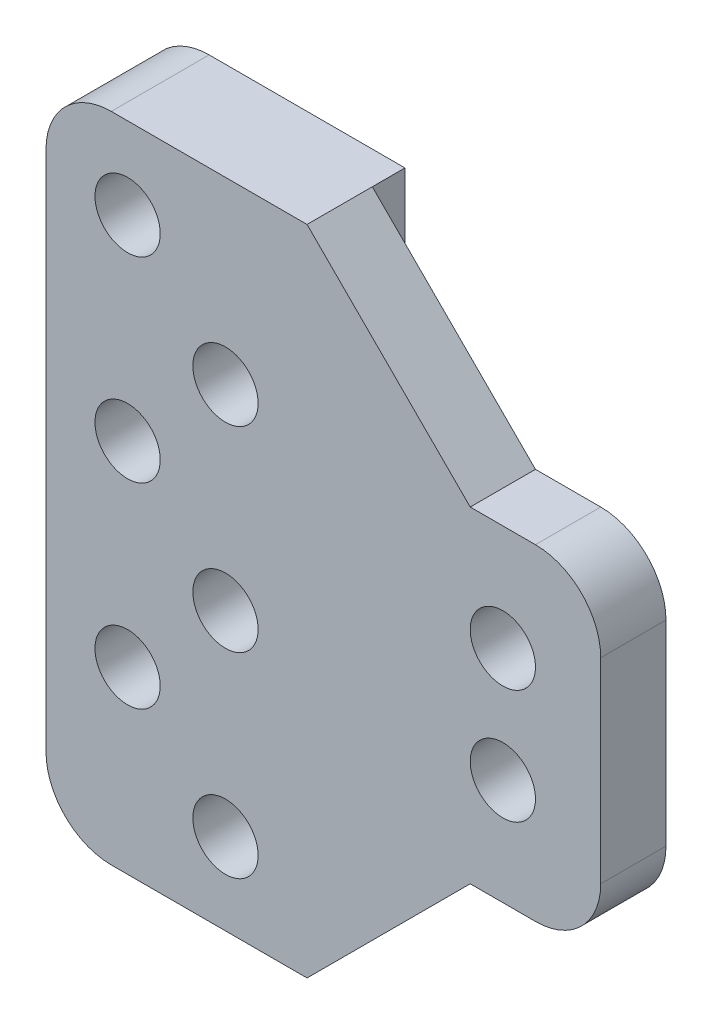
ISO-10303-21;
HEADER;
FILE_DESCRIPTION(('STEP AP214'),'2;1');
FILE_NAME('part.step','',(''),(''),'','','');
FILE_SCHEMA(('AUTOMOTIVE_DESIGN { 1 0 10303 214 1 1 1 1 }'));
ENDSEC;
DATA;
#1=APPLICATION_CONTEXT('core data for automotive mechanical design processes');
#2=APPLICATION_PROTOCOL_DEFINITION('international standard','automotive_design',2000,#1);
#3=PRODUCT_CONTEXT('',#1,'mechanical');
#4=PRODUCT('Part','Part','',(#3));
#5=PRODUCT_RELATED_PRODUCT_CATEGORY('part','',(#4));
#6=PRODUCT_DEFINITION_FORMATION('','',#4);
#7=PRODUCT_DEFINITION_CONTEXT('part definition',#1,'design');
#8=PRODUCT_DEFINITION('design','',#6,#7);
#9=PRODUCT_DEFINITION_SHAPE('','',#8);
#10=(LENGTH_UNIT() NAMED_UNIT(*) SI_UNIT(.MILLI.,.METRE.));
#11=(NAMED_UNIT(*) PLANE_ANGLE_UNIT() SI_UNIT($,.RADIAN.));
#12=(NAMED_UNIT(*) SI_UNIT($,.STERADIAN.) SOLID_ANGLE_UNIT());
#13=UNCERTAINTY_MEASURE_WITH_UNIT(LENGTH_MEASURE(1.E-05),#10,'distance_accuracy_value','');
#14=(GEOMETRIC_REPRESENTATION_CONTEXT(3) GLOBAL_UNCERTAINTY_ASSIGNED_CONTEXT((#13)) GLOBAL_UNIT_ASSIGNED_CONTEXT((#10,
#11,#12)) REPRESENTATION_CONTEXT('',''));
#15=CARTESIAN_POINT('',(0.,0.,0.));
#16=DIRECTION('',(0.,0.,1.));
#17=DIRECTION('',(1.,0.,0.));
#18=AXIS2_PLACEMENT_3D('',#15,#16,#17);
#19=CARTESIAN_POINT('',(-11.5,7.5,-3.));
#20=DIRECTION('',(0.,0.,1.));
#21=DIRECTION('',(1.,0.,0.));
#22=AXIS2_PLACEMENT_3D('',#19,#20,#21);
#23=CYLINDRICAL_SURFACE('',#22,1.);
#24=CARTESIAN_POINT('',(-11.5,7.5,-1.));
#25=DIRECTION('',(0.,0.,-1.));
#26=DIRECTION('',(-1.,0.,0.));
#27=AXIS2_PLACEMENT_3D('',#24,#25,#26);
#28=CIRCLE('',#27,1.);
#29=CARTESIAN_POINT('',(-12.5,7.5,-1.));
#30=VERTEX_POINT('',#29);
#31=EDGE_CURVE('E217',#30,#30,#28,.T.);
#32=ORIENTED_EDGE('',*,*,#31,.T.);
#33=EDGE_LOOP('',(#32));
#34=FACE_BOUND('',#33,.T.);
#35=CARTESIAN_POINT('',(-11.5,7.5,2.));
#36=DIRECTION('',(0.,0.,1.));
#37=DIRECTION('',(1.,0.,0.));
#38=AXIS2_PLACEMENT_3D('',#35,#36,#37);
#39=CIRCLE('',#38,1.);
#40=CARTESIAN_POINT('',(-10.5,7.5,2.));
#41=VERTEX_POINT('',#40);
#42=EDGE_CURVE('E220',#41,#41,#39,.T.);
#43=ORIENTED_EDGE('',*,*,#42,.T.);
#44=EDGE_LOOP('',(#43));
#45=FACE_BOUND('',#44,.T.);
#46=ADVANCED_FACE('F36',(#34,#45),#23,.F.);
#47=CARTESIAN_POINT('',(-8.5,4.5,-3.));
#48=DIRECTION('',(0.,0.,1.));
#49=DIRECTION('',(1.,0.,0.));
#50=AXIS2_PLACEMENT_3D('',#47,#48,#49);
#51=CYLINDRICAL_SURFACE('',#50,1.);
#52=CARTESIAN_POINT('',(-8.5,4.5,-1.));
#53=DIRECTION('',(0.,0.,-1.));
#54=DIRECTION('',(-1.,0.,0.));
#55=AXIS2_PLACEMENT_3D('',#52,#53,#54);
#56=CIRCLE('',#55,1.);
#57=CARTESIAN_POINT('',(-9.5,4.5,-1.));
#58=VERTEX_POINT('',#57);
#59=EDGE_CURVE('E173',#58,#58,#56,.T.);
#60=ORIENTED_EDGE('',*,*,#59,.T.);
#61=EDGE_LOOP('',(#60));
#62=FACE_BOUND('',#61,.T.);
#63=CARTESIAN_POINT('',(-8.5,4.5,2.));
#64=DIRECTION('',(0.,0.,1.));
#65=DIRECTION('',(1.,0.,0.));
#66=AXIS2_PLACEMENT_3D('',#63,#64,#65);
#67=CIRCLE('',#66,1.);
#68=CARTESIAN_POINT('',(-7.5,4.5,2.));
#69=VERTEX_POINT('',#68);
#70=EDGE_CURVE('E214',#69,#69,#67,.T.);
#71=ORIENTED_EDGE('',*,*,#70,.T.);
#72=EDGE_LOOP('',(#71));
#73=FACE_BOUND('',#72,.T.);
#74=ADVANCED_FACE('F319',(#62,#73),#51,.F.);
#75=CARTESIAN_POINT('',(0.,0.,0.));
#76=DIRECTION('',(0.,0.,1.));
#77=DIRECTION('',(1.,0.,0.));
#78=AXIS2_PLACEMENT_3D('',#75,#76,#77);
#79=PLANE('',#78);
#80=CARTESIAN_POINT('',(0.,-1.75,0.));
#81=DIRECTION('',(0.,0.,1.));
#82=DIRECTION('',(1.,0.,0.));
#83=AXIS2_PLACEMENT_3D('',#80,#81,#82);
#84=CIRCLE('',#83,1.);
#85=CARTESIAN_POINT('',(1.,-1.75,0.));
#86=VERTEX_POINT('',#85);
#87=EDGE_CURVE('E141',#86,#86,#84,.T.);
#88=ORIENTED_EDGE('',*,*,#87,.T.);
#89=EDGE_LOOP('',(#88));
#90=FACE_BOUND('',#89,.T.);
#91=CARTESIAN_POINT('',(0.,1.75,0.));
#92=DIRECTION('',(0.,0.,1.));
#93=DIRECTION('',(1.,0.,0.));
#94=AXIS2_PLACEMENT_3D('',#91,#92,#93);
#95=CIRCLE('',#94,1.);
#96=CARTESIAN_POINT('',(0.999999999999999,1.75,0.));
#97=VERTEX_POINT('',#96);
#98=EDGE_CURVE('E188',#97,#97,#95,.T.);
#99=ORIENTED_EDGE('',*,*,#98,.T.);
#100=EDGE_LOOP('',(#99));
#101=FACE_BOUND('',#100,.T.);
#102=DIRECTION('',(-1.,0.,0.));
#103=VECTOR('',#102,1.);
#104=CARTESIAN_POINT('',(-3.,5.,0.));
#105=LINE('',#104,#103);
#106=CARTESIAN_POINT('',(0.999999999999999,5.,0.));
#107=VERTEX_POINT('',#106);
#108=CARTESIAN_POINT('',(-0.999999999999968,5.,0.));
#109=VERTEX_POINT('',#108);
#110=EDGE_CURVE('E206',#107,#109,#105,.T.);
#111=ORIENTED_EDGE('',*,*,#110,.F.);
#112=CARTESIAN_POINT('',(0.999999999999999,3.,0.));
#113=DIRECTION('',(0.,0.,1.));
#114=DIRECTION('',(1.,0.,0.));
#115=AXIS2_PLACEMENT_3D('',#112,#113,#114);
#116=CIRCLE('',#115,2.);
#117=CARTESIAN_POINT('',(3.,3.,0.));
#118=VERTEX_POINT('',#117);
#119=EDGE_CURVE('E57',#107,#118,#116,.F.);
#120=ORIENTED_EDGE('',*,*,#119,.T.);
#121=DIRECTION('',(0.,1.,0.));
#122=VECTOR('',#121,1.);
#123=CARTESIAN_POINT('',(3.,5.,0.));
#124=LINE('',#123,#122);
#125=CARTESIAN_POINT('',(3.,-3.,0.));
#126=VERTEX_POINT('',#125);
#127=EDGE_CURVE('E194',#126,#118,#124,.T.);
#128=ORIENTED_EDGE('',*,*,#127,.F.);
#129=CARTESIAN_POINT('',(1.,-3.,0.));
#130=DIRECTION('',(0.,0.,1.));
#131=DIRECTION('',(1.,0.,0.));
#132=AXIS2_PLACEMENT_3D('',#129,#130,#131);
#133=CIRCLE('',#132,2.);
#134=CARTESIAN_POINT('',(1.,-5.,0.));
#135=VERTEX_POINT('',#134);
#136=EDGE_CURVE('E51',#126,#135,#133,.F.);
#137=ORIENTED_EDGE('',*,*,#136,.T.);
#138=DIRECTION('',(1.,0.,0.));
#139=VECTOR('',#138,1.);
#140=CARTESIAN_POINT('',(-3.,-5.,0.));
#141=LINE('',#140,#139);
#142=CARTESIAN_POINT('',(-1.00000000000007,-5.,0.));
#143=VERTEX_POINT('',#142);
#144=EDGE_CURVE('E201',#143,#135,#141,.T.);
#145=ORIENTED_EDGE('',*,*,#144,.F.);
#146=DIRECTION('',(-0.707106781186544,-0.707106781186551,0.));
#147=VECTOR('',#146,1.);
#148=CARTESIAN_POINT('',(1.99999999999996,-1.99999999999994,0.));
#149=LINE('',#148,#147);
#150=CARTESIAN_POINT('',(-6.00000000000005,-10.,0.));
#151=VERTEX_POINT('',#150);
#152=EDGE_CURVE('E230',#143,#151,#149,.T.);
#153=ORIENTED_EDGE('',*,*,#152,.T.);
#154=DIRECTION('',(0.,-1.,0.));
#155=VECTOR('',#154,1.);
#156=CARTESIAN_POINT('',(-6.,10.,0.));
#157=LINE('',#156,#155);
#158=CARTESIAN_POINT('',(-6.,10.,0.));
#159=VERTEX_POINT('',#158);
#160=EDGE_CURVE('E136',#159,#151,#157,.T.);
#161=ORIENTED_EDGE('',*,*,#160,.F.);
#162=DIRECTION('',(0.707106781186552,-0.707106781186544,0.));
#163=VECTOR('',#162,1.);
#164=CARTESIAN_POINT('',(2.00000000000002,2.00000000000004,0.));
#165=LINE('',#164,#163);
#166=EDGE_CURVE('E234',#159,#109,#165,.T.);
#167=ORIENTED_EDGE('',*,*,#166,.T.);
#168=EDGE_LOOP('',(#111,#120,#128,#137,#145,#153,#161,#167));
#169=FACE_BOUND('',#168,.T.);
#170=ADVANCED_FACE('F281',(#90,#101,#169),#79,.F.);
#171=CARTESIAN_POINT('',(0.,0.,2.));
#172=DIRECTION('',(0.,0.,1.));
#173=DIRECTION('',(1.,0.,0.));
#174=AXIS2_PLACEMENT_3D('',#171,#172,#173);
#175=PLANE('',#174);
#176=CARTESIAN_POINT('',(-11.5,1.5,2.));
#177=DIRECTION('',(0.,0.,1.));
#178=DIRECTION('',(1.,0.,0.));
#179=AXIS2_PLACEMENT_3D('',#176,#177,#178);
#180=CIRCLE('',#179,1.);
#181=CARTESIAN_POINT('',(-10.5,1.5,2.));
#182=VERTEX_POINT('',#181);
#183=EDGE_CURVE('E559',#182,#182,#180,.T.);
#184=ORIENTED_EDGE('',*,*,#183,.F.);
#185=EDGE_LOOP('',(#184));
#186=FACE_BOUND('',#185,.T.);
#187=CARTESIAN_POINT('',(-8.5,-1.5,2.));
#188=DIRECTION('',(0.,0.,1.));
#189=DIRECTION('',(1.,0.,0.));
#190=AXIS2_PLACEMENT_3D('',#187,#188,#189);
#191=CIRCLE('',#190,1.);
#192=CARTESIAN_POINT('',(-7.5,-1.5,2.));
#193=VERTEX_POINT('',#192);
#194=EDGE_CURVE('E563',#193,#193,#191,.T.);
#195=ORIENTED_EDGE('',*,*,#194,.F.);
#196=EDGE_LOOP('',(#195));
#197=FACE_BOUND('',#196,.T.);
#198=CARTESIAN_POINT('',(-8.5,-7.5,2.));
#199=DIRECTION('',(0.,0.,1.));
#200=DIRECTION('',(1.,0.,0.));
#201=AXIS2_PLACEMENT_3D('',#198,#199,#200);
#202=CIRCLE('',#201,1.);
#203=CARTESIAN_POINT('',(-7.5,-7.5,2.));
#204=VERTEX_POINT('',#203);
#205=EDGE_CURVE('E210',#204,#204,#202,.T.);
#206=ORIENTED_EDGE('',*,*,#205,.F.);
#207=EDGE_LOOP('',(#206));
#208=FACE_BOUND('',#207,.T.);
#209=CARTESIAN_POINT('',(-11.5,-4.5,2.));
#210=DIRECTION('',(0.,0.,1.));
#211=DIRECTION('',(1.,0.,0.));
#212=AXIS2_PLACEMENT_3D('',#209,#210,#211);
#213=CIRCLE('',#212,1.);
#214=CARTESIAN_POINT('',(-10.5,-4.5,2.));
#215=VERTEX_POINT('',#214);
#216=EDGE_CURVE('E165',#215,#215,#213,.T.);
#217=ORIENTED_EDGE('',*,*,#216,.F.);
#218=EDGE_LOOP('',(#217));
#219=FACE_BOUND('',#218,.T.);
#220=CARTESIAN_POINT('',(0.,1.75,2.));
#221=DIRECTION('',(0.,0.,1.));
#222=DIRECTION('',(1.,0.,0.));
#223=AXIS2_PLACEMENT_3D('',#220,#221,#222);
#224=CIRCLE('',#223,1.);
#225=CARTESIAN_POINT('',(0.999999999999999,1.75,2.));
#226=VERTEX_POINT('',#225);
#227=EDGE_CURVE('E191',#226,#226,#224,.T.);
#228=ORIENTED_EDGE('',*,*,#227,.F.);
#229=EDGE_LOOP('',(#228));
#230=FACE_BOUND('',#229,.T.);
#231=DIRECTION('',(0.,-1.,0.));
#232=VECTOR('',#231,1.);
#233=CARTESIAN_POINT('',(-14.,-10.,2.));
#234=LINE('',#233,#232);
#235=CARTESIAN_POINT('',(-14.,8.,2.));
#236=VERTEX_POINT('',#235);
#237=CARTESIAN_POINT('',(-14.,-8.,2.));
#238=VERTEX_POINT('',#237);
#239=EDGE_CURVE('E177',#236,#238,#234,.T.);
#240=ORIENTED_EDGE('',*,*,#239,.T.);
#241=CARTESIAN_POINT('',(-12.,-8.,2.));
#242=DIRECTION('',(0.,0.,1.));
#243=DIRECTION('',(1.,0.,0.));
#244=AXIS2_PLACEMENT_3D('',#241,#242,#243);
#245=CIRCLE('',#244,2.);
#246=CARTESIAN_POINT('',(-12.,-10.,2.));
#247=VERTEX_POINT('',#246);
#248=EDGE_CURVE('E248',#238,#247,#245,.T.);
#249=ORIENTED_EDGE('',*,*,#248,.T.);
#250=DIRECTION('',(1.,0.,0.));
#251=VECTOR('',#250,1.);
#252=CARTESIAN_POINT('',(-6.00000000000005,-10.,2.));
#253=LINE('',#252,#251);
#254=CARTESIAN_POINT('',(-6.00000000000005,-10.,2.));
#255=VERTEX_POINT('',#254);
#256=EDGE_CURVE('E180',#247,#255,#253,.T.);
#257=ORIENTED_EDGE('',*,*,#256,.T.);
#258=DIRECTION('',(0.707106781186544,0.707106781186551,0.));
#259=VECTOR('',#258,1.);
#260=CARTESIAN_POINT('',(-6.00000000000005,-10.,2.));
#261=LINE('',#260,#259);
#262=CARTESIAN_POINT('',(-1.00000000000007,-5.,2.));
#263=VERTEX_POINT('',#262);
#264=EDGE_CURVE('E228',#255,#263,#261,.T.);
#265=ORIENTED_EDGE('',*,*,#264,.T.);
#266=DIRECTION('',(1.,0.,0.));
#267=VECTOR('',#266,1.);
#268=CARTESIAN_POINT('',(-3.,-5.,2.));
#269=LINE('',#268,#267);
#270=CARTESIAN_POINT('',(1.,-5.,2.));
#271=VERTEX_POINT('',#270);
#272=EDGE_CURVE('E174',#263,#271,#269,.T.);
#273=ORIENTED_EDGE('',*,*,#272,.T.);
#274=CARTESIAN_POINT('',(1.,-3.,2.));
#275=DIRECTION('',(0.,0.,1.));
#276=DIRECTION('',(1.,0.,0.));
#277=AXIS2_PLACEMENT_3D('',#274,#275,#276);
#278=CIRCLE('',#277,2.);
#279=CARTESIAN_POINT('',(3.,-3.,2.));
#280=VERTEX_POINT('',#279);
#281=EDGE_CURVE('E242',#271,#280,#278,.T.);
#282=ORIENTED_EDGE('',*,*,#281,.T.);
#283=DIRECTION('',(0.,1.,0.));
#284=VECTOR('',#283,1.);
#285=CARTESIAN_POINT('',(3.,5.,2.));
#286=LINE('',#285,#284);
#287=CARTESIAN_POINT('',(3.,3.,2.));
#288=VERTEX_POINT('',#287);
#289=EDGE_CURVE('E197',#280,#288,#286,.T.);
#290=ORIENTED_EDGE('',*,*,#289,.T.);
#291=CARTESIAN_POINT('',(0.999999999999999,3.,2.));
#292=DIRECTION('',(0.,0.,1.));
#293=DIRECTION('',(1.,0.,0.));
#294=AXIS2_PLACEMENT_3D('',#291,#292,#293);
#295=CIRCLE('',#294,2.);
#296=CARTESIAN_POINT('',(0.999999999999999,5.,2.));
#297=VERTEX_POINT('',#296);
#298=EDGE_CURVE('E244',#288,#297,#295,.T.);
#299=ORIENTED_EDGE('',*,*,#298,.T.);
#300=DIRECTION('',(-1.,0.,0.));
#301=VECTOR('',#300,1.);
#302=CARTESIAN_POINT('',(-3.,5.,2.));
#303=LINE('',#302,#301);
#304=CARTESIAN_POINT('',(-0.999999999999968,5.,2.));
#305=VERTEX_POINT('',#304);
#306=EDGE_CURVE('E200',#297,#305,#303,.T.);
#307=ORIENTED_EDGE('',*,*,#306,.T.);
#308=DIRECTION('',(-0.707106781186552,0.707106781186544,0.));
#309=VECTOR('',#308,1.);
#310=CARTESIAN_POINT('',(-0.999999999999968,5.,2.));
#311=LINE('',#310,#309);
#312=CARTESIAN_POINT('',(-6.,10.,2.));
#313=VERTEX_POINT('',#312);
#314=EDGE_CURVE('E232',#305,#313,#311,.T.);
#315=ORIENTED_EDGE('',*,*,#314,.T.);
#316=DIRECTION('',(-1.,0.,0.));
#317=VECTOR('',#316,1.);
#318=CARTESIAN_POINT('',(-14.,10.,2.));
#319=LINE('',#318,#317);
#320=CARTESIAN_POINT('',(-12.,10.,2.));
#321=VERTEX_POINT('',#320);
#322=EDGE_CURVE('E171',#313,#321,#319,.T.);
#323=ORIENTED_EDGE('',*,*,#322,.T.);
#324=CARTESIAN_POINT('',(-12.,8.,2.));
#325=DIRECTION('',(0.,0.,1.));
#326=DIRECTION('',(1.,0.,0.));
#327=AXIS2_PLACEMENT_3D('',#324,#325,#326);
#328=CIRCLE('',#327,2.);
#329=EDGE_CURVE('E246',#321,#236,#328,.T.);
#330=ORIENTED_EDGE('',*,*,#329,.T.);
#331=EDGE_LOOP('',(#240,#249,#257,#265,#273,#282,#290,#299,#307,#315,#323,#330));
#332=FACE_BOUND('',#331,.T.);
#333=CARTESIAN_POINT('',(0.,-1.75,2.));
#334=DIRECTION('',(0.,0.,1.));
#335=DIRECTION('',(1.,0.,0.));
#336=AXIS2_PLACEMENT_3D('',#333,#334,#335);
#337=CIRCLE('',#336,1.);
#338=CARTESIAN_POINT('',(1.,-1.75,2.));
#339=VERTEX_POINT('',#338);
#340=EDGE_CURVE('E185',#339,#339,#337,.T.);
#341=ORIENTED_EDGE('',*,*,#340,.F.);
#342=EDGE_LOOP('',(#341));
#343=FACE_BOUND('',#342,.T.);
#344=ORIENTED_EDGE('',*,*,#70,.F.);
#345=EDGE_LOOP('',(#344));
#346=FACE_BOUND('',#345,.T.);
#347=ORIENTED_EDGE('',*,*,#42,.F.);
#348=EDGE_LOOP('',(#347));
#349=FACE_BOUND('',#348,.T.);
#350=ADVANCED_FACE('F273',(#186,#197,#208,#219,#230,#332,#343,#346,#349),#175,.T.);
#351=CARTESIAN_POINT('',(3.,5.,2.));
#352=DIRECTION('',(-1.,0.,0.));
#353=DIRECTION('',(0.,-1.,0.));
#354=AXIS2_PLACEMENT_3D('',#351,#352,#353);
#355=PLANE('',#354);
#356=ORIENTED_EDGE('',*,*,#127,.T.);
#357=DIRECTION('',(0.,0.,-1.));
#358=VECTOR('',#357,1.);
#359=CARTESIAN_POINT('',(3.,3.,2.));
#360=LINE('',#359,#358);
#361=EDGE_CURVE('E44',#118,#288,#360,.F.);
#362=ORIENTED_EDGE('',*,*,#361,.T.);
#363=ORIENTED_EDGE('',*,*,#289,.F.);
#364=DIRECTION('',(0.,0.,-1.));
#365=VECTOR('',#364,1.);
#366=CARTESIAN_POINT('',(3.,-3.,2.));
#367=LINE('',#366,#365);
#368=EDGE_CURVE('E263',#280,#126,#367,.T.);
#369=ORIENTED_EDGE('',*,*,#368,.T.);
#370=EDGE_LOOP('',(#356,#362,#363,#369));
#371=FACE_BOUND('',#370,.T.);
#372=ADVANCED_FACE('F268',(#371),#355,.F.);
#373=CARTESIAN_POINT('',(-3.,5.,2.));
#374=DIRECTION('',(0.,-1.,0.));
#375=DIRECTION('',(1.,0.,0.));
#376=AXIS2_PLACEMENT_3D('',#373,#374,#375);
#377=PLANE('',#376);
#378=ORIENTED_EDGE('',*,*,#306,.F.);
#379=DIRECTION('',(0.,0.,-1.));
#380=VECTOR('',#379,1.);
#381=CARTESIAN_POINT('',(0.999999999999999,5.,2.));
#382=LINE('',#381,#380);
#383=EDGE_CURVE('E258',#297,#107,#382,.T.);
#384=ORIENTED_EDGE('',*,*,#383,.T.);
#385=ORIENTED_EDGE('',*,*,#110,.T.);
#386=DIRECTION('',(0.,0.,1.));
#387=VECTOR('',#386,1.);
#388=CARTESIAN_POINT('',(-0.999999999999968,5.,2.));
#389=LINE('',#388,#387);
#390=EDGE_CURVE('E225',#109,#305,#389,.T.);
#391=ORIENTED_EDGE('',*,*,#390,.T.);
#392=EDGE_LOOP('',(#378,#384,#385,#391));
#393=FACE_BOUND('',#392,.T.);
#394=ADVANCED_FACE('F280',(#393),#377,.F.);
#395=CARTESIAN_POINT('',(-3.,-5.,2.));
#396=DIRECTION('',(0.,1.,0.));
#397=DIRECTION('',(-1.,0.,0.));
#398=AXIS2_PLACEMENT_3D('',#395,#396,#397);
#399=PLANE('',#398);
#400=ORIENTED_EDGE('',*,*,#144,.T.);
#401=DIRECTION('',(0.,0.,-1.));
#402=VECTOR('',#401,1.);
#403=CARTESIAN_POINT('',(1.,-5.,2.));
#404=LINE('',#403,#402);
#405=EDGE_CURVE('E11',#135,#271,#404,.F.);
#406=ORIENTED_EDGE('',*,*,#405,.T.);
#407=ORIENTED_EDGE('',*,*,#272,.F.);
#408=DIRECTION('',(0.,0.,-1.));
#409=VECTOR('',#408,1.);
#410=CARTESIAN_POINT('',(-1.00000000000007,-5.,2.));
#411=LINE('',#410,#409);
#412=EDGE_CURVE('E223',#263,#143,#411,.T.);
#413=ORIENTED_EDGE('',*,*,#412,.T.);
#414=EDGE_LOOP('',(#400,#406,#407,#413));
#415=FACE_BOUND('',#414,.T.);
#416=ADVANCED_FACE('F311',(#415),#399,.F.);
#417=CARTESIAN_POINT('',(0.,1.75,2.));
#418=DIRECTION('',(0.,0.,-1.));
#419=DIRECTION('',(-1.,0.,0.));
#420=AXIS2_PLACEMENT_3D('',#417,#418,#419);
#421=CYLINDRICAL_SURFACE('',#420,1.);
#422=ORIENTED_EDGE('',*,*,#227,.T.);
#423=EDGE_LOOP('',(#422));
#424=FACE_BOUND('',#423,.T.);
#425=ORIENTED_EDGE('',*,*,#98,.F.);
#426=EDGE_LOOP('',(#425));
#427=FACE_BOUND('',#426,.T.);
#428=ADVANCED_FACE('F483',(#424,#427),#421,.F.);
#429=CARTESIAN_POINT('',(0.,-1.75,2.));
#430=DIRECTION('',(0.,0.,-1.));
#431=DIRECTION('',(-1.,0.,0.));
#432=AXIS2_PLACEMENT_3D('',#429,#430,#431);
#433=CYLINDRICAL_SURFACE('',#432,1.);
#434=ORIENTED_EDGE('',*,*,#340,.T.);
#435=EDGE_LOOP('',(#434));
#436=FACE_BOUND('',#435,.T.);
#437=ORIENTED_EDGE('',*,*,#87,.F.);
#438=EDGE_LOOP('',(#437));
#439=FACE_BOUND('',#438,.T.);
#440=ADVANCED_FACE('F463',(#436,#439),#433,.F.);
#441=CARTESIAN_POINT('',(-6.00000000000005,-5.,0.));
#442=DIRECTION('',(1.,0.,0.));
#443=DIRECTION('',(0.,1.,0.));
#444=AXIS2_PLACEMENT_3D('',#441,#442,#443);
#445=PLANE('',#444);
#446=ORIENTED_EDGE('',*,*,#160,.T.);
#447=DIRECTION('',(0.,0.,1.));
#448=VECTOR('',#447,1.);
#449=CARTESIAN_POINT('',(-6.00000000000005,-10.,0.));
#450=LINE('',#449,#448);
#451=CARTESIAN_POINT('',(-6.,-10.,-1.));
#452=VERTEX_POINT('',#451);
#453=EDGE_CURVE('E130',#452,#151,#450,.T.);
#454=ORIENTED_EDGE('',*,*,#453,.F.);
#455=DIRECTION('',(0.,-1.,0.));
#456=VECTOR('',#455,1.);
#457=CARTESIAN_POINT('',(-6.,10.,-1.));
#458=LINE('',#457,#456);
#459=CARTESIAN_POINT('',(-6.,10.,-1.));
#460=VERTEX_POINT('',#459);
#461=EDGE_CURVE('E135',#460,#452,#458,.T.);
#462=ORIENTED_EDGE('',*,*,#461,.F.);
#463=DIRECTION('',(0.,0.,1.));
#464=VECTOR('',#463,1.);
#465=CARTESIAN_POINT('',(-6.,10.,0.));
#466=LINE('',#465,#464);
#467=EDGE_CURVE('E183',#460,#159,#466,.T.);
#468=ORIENTED_EDGE('',*,*,#467,.T.);
#469=EDGE_LOOP('',(#446,#454,#462,#468));
#470=FACE_BOUND('',#469,.T.);
#471=ADVANCED_FACE('F132',(#470),#445,.T.);
#472=CARTESIAN_POINT('',(-6.00000000000005,-10.,0.));
#473=DIRECTION('',(0.,-1.,0.));
#474=DIRECTION('',(1.,0.,0.));
#475=AXIS2_PLACEMENT_3D('',#472,#473,#474);
#476=PLANE('',#475);
#477=ORIENTED_EDGE('',*,*,#256,.F.);
#478=DIRECTION('',(0.,0.,1.));
#479=VECTOR('',#478,1.);
#480=CARTESIAN_POINT('',(-12.,-10.,0.));
#481=LINE('',#480,#479);
#482=CARTESIAN_POINT('',(-12.,-10.,-1.));
#483=VERTEX_POINT('',#482);
#484=EDGE_CURVE('E149',#247,#483,#481,.F.);
#485=ORIENTED_EDGE('',*,*,#484,.T.);
#486=DIRECTION('',(-1.,0.,0.));
#487=VECTOR('',#486,1.);
#488=CARTESIAN_POINT('',(-6.,-10.,-1.));
#489=LINE('',#488,#487);
#490=EDGE_CURVE('E145',#452,#483,#489,.T.);
#491=ORIENTED_EDGE('',*,*,#490,.F.);
#492=ORIENTED_EDGE('',*,*,#453,.T.);
#493=EDGE_CURVE('E142',#151,#255,#450,.T.);
#494=ORIENTED_EDGE('',*,*,#493,.T.);
#495=EDGE_LOOP('',(#477,#485,#491,#492,#494));
#496=FACE_BOUND('',#495,.T.);
#497=ADVANCED_FACE('F147',(#496),#476,.T.);
#498=CARTESIAN_POINT('',(-14.,-10.,0.));
#499=DIRECTION('',(-1.,0.,0.));
#500=DIRECTION('',(0.,-1.,0.));
#501=AXIS2_PLACEMENT_3D('',#498,#499,#500);
#502=PLANE('',#501);
#503=DIRECTION('',(0.,1.,0.));
#504=VECTOR('',#503,1.);
#505=CARTESIAN_POINT('',(-14.,10.,-1.));
#506=LINE('',#505,#504);
#507=CARTESIAN_POINT('',(-14.,-8.00000000000001,-1.));
#508=VERTEX_POINT('',#507);
#509=CARTESIAN_POINT('',(-14.,8.,-1.));
#510=VERTEX_POINT('',#509);
#511=EDGE_CURVE('E152',#508,#510,#506,.T.);
#512=ORIENTED_EDGE('',*,*,#511,.F.);
#513=DIRECTION('',(0.,0.,1.));
#514=VECTOR('',#513,1.);
#515=CARTESIAN_POINT('',(-14.,-8.,0.));
#516=LINE('',#515,#514);
#517=EDGE_CURVE('E239',#508,#238,#516,.T.);
#518=ORIENTED_EDGE('',*,*,#517,.T.);
#519=ORIENTED_EDGE('',*,*,#239,.F.);
#520=DIRECTION('',(0.,0.,1.));
#521=VECTOR('',#520,1.);
#522=CARTESIAN_POINT('',(-14.,8.,0.));
#523=LINE('',#522,#521);
#524=EDGE_CURVE('E237',#236,#510,#523,.F.);
#525=ORIENTED_EDGE('',*,*,#524,.T.);
#526=EDGE_LOOP('',(#512,#518,#519,#525));
#527=FACE_BOUND('',#526,.T.);
#528=ADVANCED_FACE('F300',(#527),#502,.T.);
#529=CARTESIAN_POINT('',(-14.,10.,0.));
#530=DIRECTION('',(0.,1.,0.));
#531=DIRECTION('',(0.,0.,1.));
#532=AXIS2_PLACEMENT_3D('',#529,#530,#531);
#533=PLANE('',#532);
#534=DIRECTION('',(1.,0.,0.));
#535=VECTOR('',#534,1.);
#536=CARTESIAN_POINT('',(-6.,10.,-1.));
#537=LINE('',#536,#535);
#538=CARTESIAN_POINT('',(-12.,10.,-1.));
#539=VERTEX_POINT('',#538);
#540=EDGE_CURVE('E157',#539,#460,#537,.T.);
#541=ORIENTED_EDGE('',*,*,#540,.F.);
#542=DIRECTION('',(0.,0.,1.));
#543=VECTOR('',#542,1.);
#544=CARTESIAN_POINT('',(-12.,10.,0.));
#545=LINE('',#544,#543);
#546=EDGE_CURVE('E255',#539,#321,#545,.T.);
#547=ORIENTED_EDGE('',*,*,#546,.T.);
#548=ORIENTED_EDGE('',*,*,#322,.F.);
#549=EDGE_CURVE('E181',#159,#313,#466,.T.);
#550=ORIENTED_EDGE('',*,*,#549,.F.);
#551=ORIENTED_EDGE('',*,*,#467,.F.);
#552=EDGE_LOOP('',(#541,#547,#548,#550,#551));
#553=FACE_BOUND('',#552,.T.);
#554=ADVANCED_FACE('F291',(#553),#533,.T.);
#555=CARTESIAN_POINT('',(0.,0.,-1.));
#556=DIRECTION('',(0.,0.,-1.));
#557=DIRECTION('',(-1.,0.,0.));
#558=AXIS2_PLACEMENT_3D('',#555,#556,#557);
#559=PLANE('',#558);
#560=CARTESIAN_POINT('',(-11.5,1.5,-1.));
#561=DIRECTION('',(0.,0.,-1.));
#562=DIRECTION('',(-1.,0.,0.));
#563=AXIS2_PLACEMENT_3D('',#560,#561,#562);
#564=CIRCLE('',#563,1.);
#565=CARTESIAN_POINT('',(-12.5,1.5,-1.));
#566=VERTEX_POINT('',#565);
#567=EDGE_CURVE('E579',#566,#566,#564,.T.);
#568=ORIENTED_EDGE('',*,*,#567,.F.);
#569=EDGE_LOOP('',(#568));
#570=FACE_BOUND('',#569,.T.);
#571=CARTESIAN_POINT('',(-8.5,-1.5,-1.));
#572=DIRECTION('',(0.,0.,-1.));
#573=DIRECTION('',(-1.,0.,0.));
#574=AXIS2_PLACEMENT_3D('',#571,#572,#573);
#575=CIRCLE('',#574,1.);
#576=CARTESIAN_POINT('',(-9.5,-1.5,-1.));
#577=VERTEX_POINT('',#576);
#578=EDGE_CURVE('E572',#577,#577,#575,.T.);
#579=ORIENTED_EDGE('',*,*,#578,.F.);
#580=EDGE_LOOP('',(#579));
#581=FACE_BOUND('',#580,.T.);
#582=CARTESIAN_POINT('',(-8.5,-7.5,-1.));
#583=DIRECTION('',(0.,0.,-1.));
#584=DIRECTION('',(-1.,0.,0.));
#585=AXIS2_PLACEMENT_3D('',#582,#583,#584);
#586=CIRCLE('',#585,1.);
#587=CARTESIAN_POINT('',(-9.5,-7.5,-1.));
#588=VERTEX_POINT('',#587);
#589=EDGE_CURVE('E159',#588,#588,#586,.T.);
#590=ORIENTED_EDGE('',*,*,#589,.F.);
#591=EDGE_LOOP('',(#590));
#592=FACE_BOUND('',#591,.T.);
#593=CARTESIAN_POINT('',(-11.5,-4.5,-1.));
#594=DIRECTION('',(0.,0.,-1.));
#595=DIRECTION('',(-1.,0.,0.));
#596=AXIS2_PLACEMENT_3D('',#593,#594,#595);
#597=CIRCLE('',#596,1.);
#598=CARTESIAN_POINT('',(-12.5,-4.5,-1.));
#599=VERTEX_POINT('',#598);
#600=EDGE_CURVE('E162',#599,#599,#597,.T.);
#601=ORIENTED_EDGE('',*,*,#600,.F.);
#602=EDGE_LOOP('',(#601));
#603=FACE_BOUND('',#602,.T.);
#604=ORIENTED_EDGE('',*,*,#490,.T.);
#605=CARTESIAN_POINT('',(-12.,-8.,-1.));
#606=DIRECTION('',(0.,0.,-1.));
#607=DIRECTION('',(-1.,0.,0.));
#608=AXIS2_PLACEMENT_3D('',#605,#606,#607);
#609=CIRCLE('',#608,2.);
#610=EDGE_CURVE('E253',#483,#508,#609,.T.);
#611=ORIENTED_EDGE('',*,*,#610,.T.);
#612=ORIENTED_EDGE('',*,*,#511,.T.);
#613=CARTESIAN_POINT('',(-12.,8.,-1.));
#614=DIRECTION('',(0.,0.,-1.));
#615=DIRECTION('',(-1.,0.,0.));
#616=AXIS2_PLACEMENT_3D('',#613,#614,#615);
#617=CIRCLE('',#616,2.);
#618=EDGE_CURVE('E251',#510,#539,#617,.T.);
#619=ORIENTED_EDGE('',*,*,#618,.T.);
#620=ORIENTED_EDGE('',*,*,#540,.T.);
#621=ORIENTED_EDGE('',*,*,#461,.T.);
#622=EDGE_LOOP('',(#604,#611,#612,#619,#620,#621));
#623=FACE_BOUND('',#622,.T.);
#624=ORIENTED_EDGE('',*,*,#59,.F.);
#625=EDGE_LOOP('',(#624));
#626=FACE_BOUND('',#625,.T.);
#627=ORIENTED_EDGE('',*,*,#31,.F.);
#628=EDGE_LOOP('',(#627));
#629=FACE_BOUND('',#628,.T.);
#630=ADVANCED_FACE('F154',(#570,#581,#592,#603,#623,#626,#629),#559,.T.);
#631=CARTESIAN_POINT('',(-11.5,-4.5,-3.));
#632=DIRECTION('',(0.,0.,1.));
#633=DIRECTION('',(1.,0.,0.));
#634=AXIS2_PLACEMENT_3D('',#631,#632,#633);
#635=CYLINDRICAL_SURFACE('',#634,1.);
#636=ORIENTED_EDGE('',*,*,#600,.T.);
#637=EDGE_LOOP('',(#636));
#638=FACE_BOUND('',#637,.T.);
#639=ORIENTED_EDGE('',*,*,#216,.T.);
#640=EDGE_LOOP('',(#639));
#641=FACE_BOUND('',#640,.T.);
#642=ADVANCED_FACE('F406',(#638,#641),#635,.F.);
#643=CARTESIAN_POINT('',(-8.5,-7.5,-3.));
#644=DIRECTION('',(0.,0.,1.));
#645=DIRECTION('',(1.,0.,0.));
#646=AXIS2_PLACEMENT_3D('',#643,#644,#645);
#647=CYLINDRICAL_SURFACE('',#646,1.);
#648=ORIENTED_EDGE('',*,*,#589,.T.);
#649=EDGE_LOOP('',(#648));
#650=FACE_BOUND('',#649,.T.);
#651=ORIENTED_EDGE('',*,*,#205,.T.);
#652=EDGE_LOOP('',(#651));
#653=FACE_BOUND('',#652,.T.);
#654=ADVANCED_FACE('F388',(#650,#653),#647,.F.);
#655=CARTESIAN_POINT('',(-8.5,-1.5,-3.));
#656=DIRECTION('',(0.,0.,1.));
#657=DIRECTION('',(1.,0.,0.));
#658=AXIS2_PLACEMENT_3D('',#655,#656,#657);
#659=CYLINDRICAL_SURFACE('',#658,1.);
#660=ORIENTED_EDGE('',*,*,#578,.T.);
#661=EDGE_LOOP('',(#660));
#662=FACE_BOUND('',#661,.T.);
#663=ORIENTED_EDGE('',*,*,#194,.T.);
#664=EDGE_LOOP('',(#663));
#665=FACE_BOUND('',#664,.T.);
#666=ADVANCED_FACE('F379',(#662,#665),#659,.F.);
#667=CARTESIAN_POINT('',(-11.5,1.5,-3.));
#668=DIRECTION('',(0.,0.,1.));
#669=DIRECTION('',(1.,0.,0.));
#670=AXIS2_PLACEMENT_3D('',#667,#668,#669);
#671=CYLINDRICAL_SURFACE('',#670,1.);
#672=ORIENTED_EDGE('',*,*,#567,.T.);
#673=EDGE_LOOP('',(#672));
#674=FACE_BOUND('',#673,.T.);
#675=ORIENTED_EDGE('',*,*,#183,.T.);
#676=EDGE_LOOP('',(#675));
#677=FACE_BOUND('',#676,.T.);
#678=ADVANCED_FACE('F332',(#674,#677),#671,.F.);
#679=CARTESIAN_POINT('',(-6.00000000000005,-10.,0.));
#680=DIRECTION('',(-0.707106781186551,0.707106781186544,0.));
#681=DIRECTION('',(0.,0.,1.));
#682=AXIS2_PLACEMENT_3D('',#679,#680,#681);
#683=PLANE('',#682);
#684=ORIENTED_EDGE('',*,*,#152,.F.);
#685=ORIENTED_EDGE('',*,*,#412,.F.);
#686=ORIENTED_EDGE('',*,*,#264,.F.);
#687=ORIENTED_EDGE('',*,*,#493,.F.);
#688=EDGE_LOOP('',(#684,#685,#686,#687));
#689=FACE_BOUND('',#688,.T.);
#690=ADVANCED_FACE('F307',(#689),#683,.F.);
#691=CARTESIAN_POINT('',(-0.999999999999968,5.,2.));
#692=DIRECTION('',(-0.707106781186543,-0.707106781186551,0.));
#693=DIRECTION('',(0.,0.,1.));
#694=AXIS2_PLACEMENT_3D('',#691,#692,#693);
#695=PLANE('',#694);
#696=ORIENTED_EDGE('',*,*,#166,.F.);
#697=ORIENTED_EDGE('',*,*,#549,.T.);
#698=ORIENTED_EDGE('',*,*,#314,.F.);
#699=ORIENTED_EDGE('',*,*,#390,.F.);
#700=EDGE_LOOP('',(#696,#697,#698,#699));
#701=FACE_BOUND('',#700,.T.);
#702=ADVANCED_FACE('F288',(#701),#695,.F.);
#703=CARTESIAN_POINT('',(-12.,-8.,0.));
#704=DIRECTION('',(0.,0.,1.));
#705=DIRECTION('',(1.,0.,0.));
#706=AXIS2_PLACEMENT_3D('',#703,#704,#705);
#707=CYLINDRICAL_SURFACE('',#706,2.);
#708=ORIENTED_EDGE('',*,*,#610,.F.);
#709=ORIENTED_EDGE('',*,*,#484,.F.);
#710=ORIENTED_EDGE('',*,*,#248,.F.);
#711=ORIENTED_EDGE('',*,*,#517,.F.);
#712=EDGE_LOOP('',(#708,#709,#710,#711));
#713=FACE_BOUND('',#712,.T.);
#714=ADVANCED_FACE('F303',(#713),#707,.T.);
#715=CARTESIAN_POINT('',(-12.,8.,0.));
#716=DIRECTION('',(0.,0.,1.));
#717=DIRECTION('',(1.,0.,0.));
#718=AXIS2_PLACEMENT_3D('',#715,#716,#717);
#719=CYLINDRICAL_SURFACE('',#718,2.);
#720=ORIENTED_EDGE('',*,*,#618,.F.);
#721=ORIENTED_EDGE('',*,*,#524,.F.);
#722=ORIENTED_EDGE('',*,*,#329,.F.);
#723=ORIENTED_EDGE('',*,*,#546,.F.);
#724=EDGE_LOOP('',(#720,#721,#722,#723));
#725=FACE_BOUND('',#724,.T.);
#726=ADVANCED_FACE('F295',(#725),#719,.T.);
#727=CARTESIAN_POINT('',(0.999999999999999,3.,2.));
#728=DIRECTION('',(0.,0.,-1.));
#729=DIRECTION('',(-1.,0.,0.));
#730=AXIS2_PLACEMENT_3D('',#727,#728,#729);
#731=CYLINDRICAL_SURFACE('',#730,2.);
#732=ORIENTED_EDGE('',*,*,#298,.F.);
#733=ORIENTED_EDGE('',*,*,#361,.F.);
#734=ORIENTED_EDGE('',*,*,#119,.F.);
#735=ORIENTED_EDGE('',*,*,#383,.F.);
#736=EDGE_LOOP('',(#732,#733,#734,#735));
#737=FACE_BOUND('',#736,.T.);
#738=ADVANCED_FACE('F278',(#737),#731,.T.);
#739=CARTESIAN_POINT('',(1.,-3.,2.));
#740=DIRECTION('',(0.,0.,-1.));
#741=DIRECTION('',(-1.,0.,0.));
#742=AXIS2_PLACEMENT_3D('',#739,#740,#741);
#743=CYLINDRICAL_SURFACE('',#742,2.);
#744=ORIENTED_EDGE('',*,*,#281,.F.);
#745=ORIENTED_EDGE('',*,*,#405,.F.);
#746=ORIENTED_EDGE('',*,*,#136,.F.);
#747=ORIENTED_EDGE('',*,*,#368,.F.);
#748=EDGE_LOOP('',(#744,#745,#746,#747));
#749=FACE_BOUND('',#748,.T.);
#750=ADVANCED_FACE('F38',(#749),#743,.T.);
#751=CLOSED_SHELL('',(#46,#74,#170,#350,#372,#394,#416,#428,#440,#471,#497,#528,#554,#630,#642,
#654,#666,#678,#690,#702,#714,#726,#738,#750));
#752=MANIFOLD_SOLID_BREP('B2',#751);
#753=ADVANCED_BREP_SHAPE_REPRESENTATION('',(#18,#752),#14);
#754=SHAPE_DEFINITION_REPRESENTATION(#9,#753);
ENDSEC;
END-ISO-10303-21;
